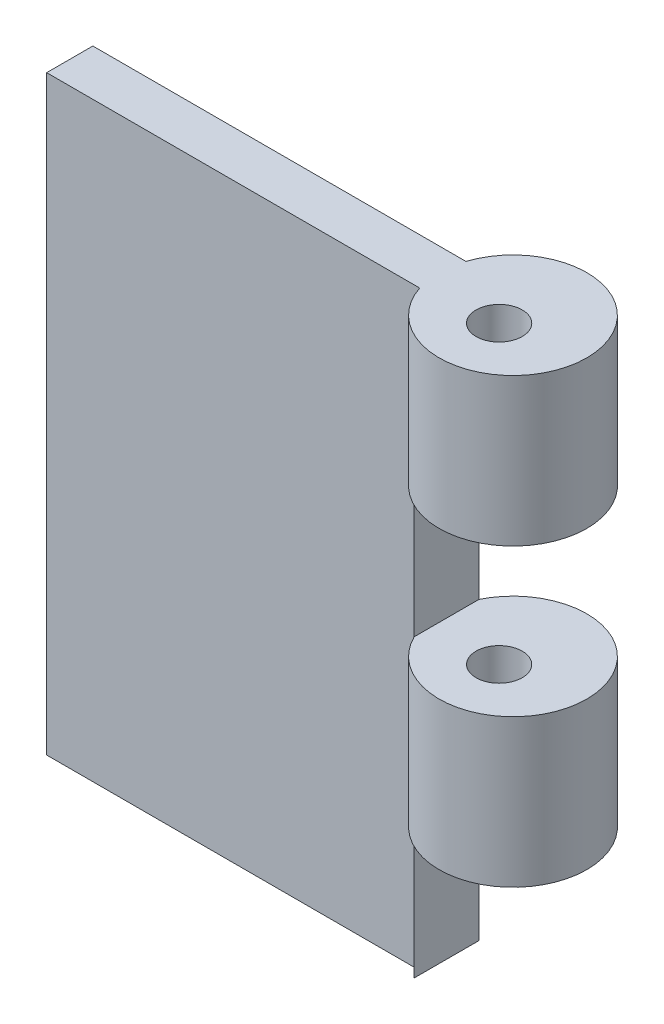
ISO-10303-21;
HEADER;
FILE_DESCRIPTION(('STEP AP214'),'2;1');
FILE_NAME('part.step','',(''),(''),'','','');
FILE_SCHEMA(('AUTOMOTIVE_DESIGN { 1 0 10303 214 1 1 1 1 }'));
ENDSEC;
DATA;
#1=APPLICATION_CONTEXT('core data for automotive mechanical design processes');
#2=APPLICATION_PROTOCOL_DEFINITION('international standard','automotive_design',2000,#1);
#3=PRODUCT_CONTEXT('',#1,'mechanical');
#4=PRODUCT('Part','Part','',(#3));
#5=PRODUCT_RELATED_PRODUCT_CATEGORY('part','',(#4));
#6=PRODUCT_DEFINITION_FORMATION('','',#4);
#7=PRODUCT_DEFINITION_CONTEXT('part definition',#1,'design');
#8=PRODUCT_DEFINITION('design','',#6,#7);
#9=PRODUCT_DEFINITION_SHAPE('','',#8);
#10=(LENGTH_UNIT() NAMED_UNIT(*) SI_UNIT(.MILLI.,.METRE.));
#11=(NAMED_UNIT(*) PLANE_ANGLE_UNIT() SI_UNIT($,.RADIAN.));
#12=(NAMED_UNIT(*) SI_UNIT($,.STERADIAN.) SOLID_ANGLE_UNIT());
#13=UNCERTAINTY_MEASURE_WITH_UNIT(LENGTH_MEASURE(1.E-05),#10,'distance_accuracy_value','');
#14=(GEOMETRIC_REPRESENTATION_CONTEXT(3) GLOBAL_UNCERTAINTY_ASSIGNED_CONTEXT((#13)) GLOBAL_UNIT_ASSIGNED_CONTEXT((#10,
#11,#12)) REPRESENTATION_CONTEXT('',''));
#15=CARTESIAN_POINT('',(0.,0.,0.));
#16=DIRECTION('',(0.,0.,1.));
#17=DIRECTION('',(1.,0.,0.));
#18=AXIS2_PLACEMENT_3D('',#15,#16,#17);
#19=CARTESIAN_POINT('',(7.61999999999999,10.16,1.27));
#20=DIRECTION('',(0.,1.,0.));
#21=DIRECTION('',(0.,0.,1.));
#22=AXIS2_PLACEMENT_3D('',#19,#20,#21);
#23=CYLINDRICAL_SURFACE('',#22,0.793749999999992);
#24=CARTESIAN_POINT('',(7.61999999999999,5.08,1.27));
#25=DIRECTION('',(0.,1.,0.));
#26=DIRECTION('',(-1.,0.,0.));
#27=AXIS2_PLACEMENT_3D('',#24,#25,#26);
#28=CIRCLE('',#27,0.793749999999992);
#29=CARTESIAN_POINT('',(6.82625,5.08,1.27));
#30=VERTEX_POINT('',#29);
#31=EDGE_CURVE('E153',#30,#30,#28,.F.);
#32=ORIENTED_EDGE('',*,*,#31,.T.);
#33=EDGE_LOOP('',(#32));
#34=FACE_BOUND('',#33,.T.);
#35=CARTESIAN_POINT('',(7.61999999999999,10.16,1.27));
#36=DIRECTION('',(0.,1.,0.));
#37=DIRECTION('',(0.,0.,1.));
#38=AXIS2_PLACEMENT_3D('',#35,#36,#37);
#39=CIRCLE('',#38,0.793749999999987);
#40=CARTESIAN_POINT('',(7.61999999999999,10.16,2.06374999999999));
#41=VERTEX_POINT('',#40);
#42=EDGE_CURVE('E171',#41,#41,#39,.T.);
#43=ORIENTED_EDGE('',*,*,#42,.T.);
#44=EDGE_LOOP('',(#43));
#45=FACE_BOUND('',#44,.T.);
#46=ADVANCED_FACE('F35',(#34,#45),#23,.F.);
#47=CARTESIAN_POINT('',(-7.62000000000001,10.16,1.5875));
#48=DIRECTION('',(0.,-1.,0.));
#49=DIRECTION('',(0.,0.,-1.));
#50=AXIS2_PLACEMENT_3D('',#47,#48,#49);
#51=PLANE('',#50);
#52=ORIENTED_EDGE('',*,*,#42,.F.);
#53=EDGE_LOOP('',(#52));
#54=FACE_BOUND('',#53,.T.);
#55=DIRECTION('',(-1.,0.,0.));
#56=VECTOR('',#55,1.);
#57=CARTESIAN_POINT('',(-7.62000000000001,10.16,1.5875));
#58=LINE('',#57,#56);
#59=CARTESIAN_POINT('',(5.20720889062065,10.16,1.5875));
#60=VERTEX_POINT('',#59);
#61=CARTESIAN_POINT('',(-7.62000000000001,10.16,1.5875));
#62=VERTEX_POINT('',#61);
#63=EDGE_CURVE('E129',#60,#62,#58,.T.);
#64=ORIENTED_EDGE('',*,*,#63,.F.);
#65=CARTESIAN_POINT('',(7.61999999999999,10.16,0.79375));
#66=DIRECTION('',(0.,-1.,0.));
#67=DIRECTION('',(0.,0.,-1.));
#68=AXIS2_PLACEMENT_3D('',#65,#66,#67);
#69=CIRCLE('',#68,2.54);
#70=CARTESIAN_POINT('',(5.20720889062065,10.16,0.));
#71=VERTEX_POINT('',#70);
#72=EDGE_CURVE('E125',#71,#60,#69,.T.);
#73=ORIENTED_EDGE('',*,*,#72,.F.);
#74=DIRECTION('',(-1.,0.,0.));
#75=VECTOR('',#74,1.);
#76=CARTESIAN_POINT('',(-7.62000000000001,10.16,0.));
#77=LINE('',#76,#75);
#78=CARTESIAN_POINT('',(-7.62000000000001,10.16,0.));
#79=VERTEX_POINT('',#78);
#80=EDGE_CURVE('E123',#71,#79,#77,.T.);
#81=ORIENTED_EDGE('',*,*,#80,.T.);
#82=DIRECTION('',(0.,0.,-1.));
#83=VECTOR('',#82,1.);
#84=CARTESIAN_POINT('',(-7.62000000000001,10.16,1.5875));
#85=LINE('',#84,#83);
#86=EDGE_CURVE('E142',#62,#79,#85,.T.);
#87=ORIENTED_EDGE('',*,*,#86,.F.);
#88=EDGE_LOOP('',(#64,#73,#81,#87));
#89=FACE_BOUND('',#88,.T.);
#90=ADVANCED_FACE('F37',(#54,#89),#51,.F.);
#91=CARTESIAN_POINT('',(-7.62000000000001,-10.16,1.5875));
#92=DIRECTION('',(1.,0.,0.));
#93=DIRECTION('',(0.,0.,-1.));
#94=AXIS2_PLACEMENT_3D('',#91,#92,#93);
#95=PLANE('',#94);
#96=DIRECTION('',(0.,-1.,0.));
#97=VECTOR('',#96,1.);
#98=CARTESIAN_POINT('',(-7.62000000000001,-10.16,0.));
#99=LINE('',#98,#97);
#100=CARTESIAN_POINT('',(-7.62000000000001,-10.16,0.));
#101=VERTEX_POINT('',#100);
#102=EDGE_CURVE('E138',#79,#101,#99,.T.);
#103=ORIENTED_EDGE('',*,*,#102,.T.);
#104=DIRECTION('',(0.,0.,-1.));
#105=VECTOR('',#104,1.);
#106=CARTESIAN_POINT('',(-7.62000000000001,-10.16,1.5875));
#107=LINE('',#106,#105);
#108=CARTESIAN_POINT('',(-7.62000000000001,-10.16,1.5875));
#109=VERTEX_POINT('',#108);
#110=EDGE_CURVE('E136',#109,#101,#107,.T.);
#111=ORIENTED_EDGE('',*,*,#110,.F.);
#112=DIRECTION('',(0.,-1.,0.));
#113=VECTOR('',#112,1.);
#114=CARTESIAN_POINT('',(-7.62000000000001,-10.16,1.5875));
#115=LINE('',#114,#113);
#116=EDGE_CURVE('E131',#62,#109,#115,.T.);
#117=ORIENTED_EDGE('',*,*,#116,.F.);
#118=ORIENTED_EDGE('',*,*,#86,.T.);
#119=EDGE_LOOP('',(#103,#111,#117,#118));
#120=FACE_BOUND('',#119,.T.);
#121=ADVANCED_FACE('F187',(#120),#95,.F.);
#122=CARTESIAN_POINT('',(-7.62000000000001,-10.16,1.5875));
#123=DIRECTION('',(0.,1.,0.));
#124=DIRECTION('',(0.,0.,1.));
#125=AXIS2_PLACEMENT_3D('',#122,#123,#124);
#126=PLANE('',#125);
#127=CARTESIAN_POINT('',(7.61999999999999,-10.16,0.79375));
#128=DIRECTION('',(0.,-1.,0.));
#129=DIRECTION('',(0.,0.,-1.));
#130=AXIS2_PLACEMENT_3D('',#127,#128,#129);
#131=CIRCLE('',#130,2.54);
#132=CARTESIAN_POINT('',(5.20720889062065,-10.16,0.));
#133=VERTEX_POINT('',#132);
#134=CARTESIAN_POINT('',(5.33735489851311,-10.16,-0.320310743702045));
#135=VERTEX_POINT('',#134);
#136=EDGE_CURVE('E111',#133,#135,#131,.T.);
#137=ORIENTED_EDGE('',*,*,#136,.T.);
#138=DIRECTION('',(0.,0.,1.));
#139=VECTOR('',#138,1.);
#140=CARTESIAN_POINT('',(5.33735489851311,-10.16,-4.7625));
#141=LINE('',#140,#139);
#142=CARTESIAN_POINT('',(5.33735489851311,-10.16,1.90781074370205));
#143=VERTEX_POINT('',#142);
#144=EDGE_CURVE('E98',#135,#143,#141,.T.);
#145=ORIENTED_EDGE('',*,*,#144,.T.);
#146=CARTESIAN_POINT('',(5.20720889062065,-10.16,1.5875));
#147=VERTEX_POINT('',#146);
#148=EDGE_CURVE('E120',#143,#147,#131,.T.);
#149=ORIENTED_EDGE('',*,*,#148,.T.);
#150=DIRECTION('',(1.,0.,0.));
#151=VECTOR('',#150,1.);
#152=CARTESIAN_POINT('',(-7.62000000000001,-10.16,1.5875));
#153=LINE('',#152,#151);
#154=EDGE_CURVE('E133',#109,#147,#153,.T.);
#155=ORIENTED_EDGE('',*,*,#154,.F.);
#156=ORIENTED_EDGE('',*,*,#110,.T.);
#157=DIRECTION('',(1.,0.,0.));
#158=VECTOR('',#157,1.);
#159=CARTESIAN_POINT('',(-7.62000000000001,-10.16,0.));
#160=LINE('',#159,#158);
#161=EDGE_CURVE('E118',#101,#133,#160,.T.);
#162=ORIENTED_EDGE('',*,*,#161,.T.);
#163=EDGE_LOOP('',(#137,#145,#149,#155,#156,#162));
#164=FACE_BOUND('',#163,.T.);
#165=ADVANCED_FACE('F115',(#164),#126,.F.);
#166=CARTESIAN_POINT('',(0.,0.,1.5875));
#167=DIRECTION('',(0.,0.,-1.));
#168=DIRECTION('',(-1.,0.,0.));
#169=AXIS2_PLACEMENT_3D('',#166,#167,#168);
#170=PLANE('',#169);
#171=ORIENTED_EDGE('',*,*,#154,.T.);
#172=DIRECTION('',(0.,-1.,0.));
#173=VECTOR('',#172,1.);
#174=CARTESIAN_POINT('',(5.20720889062065,-10.16,1.5875));
#175=LINE('',#174,#173);
#176=EDGE_CURVE('E119',#147,#60,#175,.F.);
#177=ORIENTED_EDGE('',*,*,#176,.T.);
#178=ORIENTED_EDGE('',*,*,#63,.T.);
#179=ORIENTED_EDGE('',*,*,#116,.T.);
#180=EDGE_LOOP('',(#171,#177,#178,#179));
#181=FACE_BOUND('',#180,.T.);
#182=ADVANCED_FACE('F180',(#181),#170,.F.);
#183=CARTESIAN_POINT('',(0.,0.,0.));
#184=DIRECTION('',(0.,0.,-1.));
#185=DIRECTION('',(-1.,0.,0.));
#186=AXIS2_PLACEMENT_3D('',#183,#184,#185);
#187=PLANE('',#186);
#188=DIRECTION('',(0.,-1.,0.));
#189=VECTOR('',#188,1.);
#190=CARTESIAN_POINT('',(5.20720889062065,-10.16,0.));
#191=LINE('',#190,#189);
#192=EDGE_CURVE('E145',#133,#71,#191,.F.);
#193=ORIENTED_EDGE('',*,*,#192,.F.);
#194=ORIENTED_EDGE('',*,*,#161,.F.);
#195=ORIENTED_EDGE('',*,*,#102,.F.);
#196=ORIENTED_EDGE('',*,*,#80,.F.);
#197=EDGE_LOOP('',(#193,#194,#195,#196));
#198=FACE_BOUND('',#197,.T.);
#199=ADVANCED_FACE('F189',(#198),#187,.T.);
#200=CARTESIAN_POINT('',(7.61999999999999,-10.16,0.79375));
#201=DIRECTION('',(0.,-1.,0.));
#202=DIRECTION('',(0.,0.,-1.));
#203=AXIS2_PLACEMENT_3D('',#200,#201,#202);
#204=CYLINDRICAL_SURFACE('',#203,2.54);
#205=DIRECTION('',(0.,-1.,0.));
#206=VECTOR('',#205,1.);
#207=CARTESIAN_POINT('',(5.33735489851311,-10.16,-0.320310743702045));
#208=LINE('',#207,#206);
#209=CARTESIAN_POINT('',(5.33735489851311,-5.08,-0.320310743702044));
#210=VERTEX_POINT('',#209);
#211=EDGE_CURVE('E11',#135,#210,#208,.F.);
#212=ORIENTED_EDGE('',*,*,#211,.F.);
#213=ORIENTED_EDGE('',*,*,#136,.F.);
#214=ORIENTED_EDGE('',*,*,#192,.T.);
#215=ORIENTED_EDGE('',*,*,#72,.T.);
#216=ORIENTED_EDGE('',*,*,#176,.F.);
#217=ORIENTED_EDGE('',*,*,#148,.F.);
#218=DIRECTION('',(0.,-1.,0.));
#219=VECTOR('',#218,1.);
#220=CARTESIAN_POINT('',(5.33735489851311,-10.16,1.90781074370205));
#221=LINE('',#220,#219);
#222=CARTESIAN_POINT('',(5.33735489851311,-5.08,1.90781074370204));
#223=VERTEX_POINT('',#222);
#224=EDGE_CURVE('E43',#223,#143,#221,.T.);
#225=ORIENTED_EDGE('',*,*,#224,.F.);
#226=CARTESIAN_POINT('',(7.61999999999999,-5.08,0.79375));
#227=DIRECTION('',(0.,1.,0.));
#228=DIRECTION('',(-1.,0.,0.));
#229=AXIS2_PLACEMENT_3D('',#226,#227,#228);
#230=CIRCLE('',#229,2.54);
#231=EDGE_CURVE('E113',#210,#223,#230,.F.);
#232=ORIENTED_EDGE('',*,*,#231,.F.);
#233=EDGE_LOOP('',(#212,#213,#214,#215,#216,#217,#225,#232));
#234=FACE_BOUND('',#233,.T.);
#235=CARTESIAN_POINT('',(7.61999999999999,5.08,0.79375));
#236=DIRECTION('',(0.,1.,0.));
#237=DIRECTION('',(-1.,0.,0.));
#238=AXIS2_PLACEMENT_3D('',#235,#236,#237);
#239=CIRCLE('',#238,2.54);
#240=CARTESIAN_POINT('',(5.33735489851311,5.08,-0.320310743702044));
#241=VERTEX_POINT('',#240);
#242=CARTESIAN_POINT('',(5.33735489851311,5.08,1.90781074370204));
#243=VERTEX_POINT('',#242);
#244=EDGE_CURVE('E156',#241,#243,#239,.F.);
#245=ORIENTED_EDGE('',*,*,#244,.F.);
#246=DIRECTION('',(0.,-1.,0.));
#247=VECTOR('',#246,1.);
#248=CARTESIAN_POINT('',(5.33735489851311,-10.16,-0.320310743702049));
#249=LINE('',#248,#247);
#250=CARTESIAN_POINT('',(5.33735489851311,0.,-0.320310743702045));
#251=VERTEX_POINT('',#250);
#252=EDGE_CURVE('E158',#251,#241,#249,.F.);
#253=ORIENTED_EDGE('',*,*,#252,.F.);
#254=CARTESIAN_POINT('',(7.61999999999999,0.,0.79375));
#255=DIRECTION('',(0.,-1.,0.));
#256=DIRECTION('',(0.,0.,-1.));
#257=AXIS2_PLACEMENT_3D('',#254,#255,#256);
#258=CIRCLE('',#257,2.54);
#259=CARTESIAN_POINT('',(5.33735489851311,0.,1.90781074370205));
#260=VERTEX_POINT('',#259);
#261=EDGE_CURVE('E151',#260,#251,#258,.F.);
#262=ORIENTED_EDGE('',*,*,#261,.F.);
#263=DIRECTION('',(0.,-1.,0.));
#264=VECTOR('',#263,1.);
#265=CARTESIAN_POINT('',(5.33735489851311,-10.16,1.90781074370205));
#266=LINE('',#265,#264);
#267=EDGE_CURVE('E147',#243,#260,#266,.T.);
#268=ORIENTED_EDGE('',*,*,#267,.F.);
#269=EDGE_LOOP('',(#245,#253,#262,#268));
#270=FACE_BOUND('',#269,.T.);
#271=ADVANCED_FACE('F108',(#234,#270),#204,.T.);
#272=CARTESIAN_POINT('',(7.61999999999999,-5.08,1.27));
#273=DIRECTION('',(0.,1.,0.));
#274=DIRECTION('',(-1.,0.,0.));
#275=AXIS2_PLACEMENT_3D('',#272,#273,#274);
#276=CIRCLE('',#275,0.793749999999992);
#277=CARTESIAN_POINT('',(6.82625,-5.08,1.27));
#278=VERTEX_POINT('',#277);
#279=EDGE_CURVE('E160',#278,#278,#276,.F.);
#280=ORIENTED_EDGE('',*,*,#279,.T.);
#281=EDGE_LOOP('',(#280));
#282=FACE_BOUND('',#281,.T.);
#283=CARTESIAN_POINT('',(7.61999999999999,0.,1.27));
#284=DIRECTION('',(0.,-1.,0.));
#285=DIRECTION('',(0.,0.,-1.));
#286=AXIS2_PLACEMENT_3D('',#283,#284,#285);
#287=CIRCLE('',#286,0.793749999999992);
#288=CARTESIAN_POINT('',(7.61999999999999,0.,0.476250000000008));
#289=VERTEX_POINT('',#288);
#290=EDGE_CURVE('E148',#289,#289,#287,.F.);
#291=ORIENTED_EDGE('',*,*,#290,.T.);
#292=EDGE_LOOP('',(#291));
#293=FACE_BOUND('',#292,.T.);
#294=ADVANCED_FACE('F196',(#282,#293),#23,.F.);
#295=CARTESIAN_POINT('',(5.33735489851311,5.08,-4.7625));
#296=DIRECTION('',(0.,1.,0.));
#297=DIRECTION('',(-1.,0.,0.));
#298=AXIS2_PLACEMENT_3D('',#295,#296,#297);
#299=PLANE('',#298);
#300=ORIENTED_EDGE('',*,*,#244,.T.);
#301=DIRECTION('',(0.,0.,1.));
#302=VECTOR('',#301,1.);
#303=CARTESIAN_POINT('',(5.33735489851311,5.08,-4.7625));
#304=LINE('',#303,#302);
#305=EDGE_CURVE('E152',#241,#243,#304,.T.);
#306=ORIENTED_EDGE('',*,*,#305,.F.);
#307=EDGE_LOOP('',(#300,#306));
#308=FACE_BOUND('',#307,.T.);
#309=ORIENTED_EDGE('',*,*,#31,.F.);
#310=EDGE_LOOP('',(#309));
#311=FACE_BOUND('',#310,.T.);
#312=ADVANCED_FACE('F209',(#308,#311),#299,.F.);
#313=CARTESIAN_POINT('',(5.33735489851311,0.,-4.7625));
#314=DIRECTION('',(0.,-1.,0.));
#315=DIRECTION('',(0.,0.,-1.));
#316=AXIS2_PLACEMENT_3D('',#313,#314,#315);
#317=PLANE('',#316);
#318=ORIENTED_EDGE('',*,*,#261,.T.);
#319=DIRECTION('',(0.,0.,1.));
#320=VECTOR('',#319,1.);
#321=CARTESIAN_POINT('',(5.33735489851311,0.,-4.7625));
#322=LINE('',#321,#320);
#323=EDGE_CURVE('E55',#251,#260,#322,.T.);
#324=ORIENTED_EDGE('',*,*,#323,.T.);
#325=EDGE_LOOP('',(#318,#324));
#326=FACE_BOUND('',#325,.T.);
#327=ORIENTED_EDGE('',*,*,#290,.F.);
#328=EDGE_LOOP('',(#327));
#329=FACE_BOUND('',#328,.T.);
#330=ADVANCED_FACE('F213',(#326,#329),#317,.F.);
#331=CARTESIAN_POINT('',(5.33735489851311,5.08,-4.7625));
#332=DIRECTION('',(-1.,0.,0.));
#333=DIRECTION('',(0.,-1.,0.));
#334=AXIS2_PLACEMENT_3D('',#331,#332,#333);
#335=PLANE('',#334);
#336=ORIENTED_EDGE('',*,*,#252,.T.);
#337=ORIENTED_EDGE('',*,*,#305,.T.);
#338=ORIENTED_EDGE('',*,*,#267,.T.);
#339=ORIENTED_EDGE('',*,*,#323,.F.);
#340=EDGE_LOOP('',(#336,#337,#338,#339));
#341=FACE_BOUND('',#340,.T.);
#342=ADVANCED_FACE('F220',(#341),#335,.F.);
#343=CARTESIAN_POINT('',(5.33735489851311,-5.08,-4.7625));
#344=DIRECTION('',(0.,1.,0.));
#345=DIRECTION('',(-1.,0.,0.));
#346=AXIS2_PLACEMENT_3D('',#343,#344,#345);
#347=PLANE('',#346);
#348=ORIENTED_EDGE('',*,*,#231,.T.);
#349=DIRECTION('',(0.,0.,1.));
#350=VECTOR('',#349,1.);
#351=CARTESIAN_POINT('',(5.33735489851311,-5.08,-4.7625));
#352=LINE('',#351,#350);
#353=EDGE_CURVE('E49',#210,#223,#352,.T.);
#354=ORIENTED_EDGE('',*,*,#353,.F.);
#355=EDGE_LOOP('',(#348,#354));
#356=FACE_BOUND('',#355,.T.);
#357=ORIENTED_EDGE('',*,*,#279,.F.);
#358=EDGE_LOOP('',(#357));
#359=FACE_BOUND('',#358,.T.);
#360=ADVANCED_FACE('F225',(#356,#359),#347,.F.);
#361=CARTESIAN_POINT('',(5.33735489851311,-5.08,-4.7625));
#362=DIRECTION('',(-1.,0.,0.));
#363=DIRECTION('',(0.,-1.,0.));
#364=AXIS2_PLACEMENT_3D('',#361,#362,#363);
#365=PLANE('',#364);
#366=ORIENTED_EDGE('',*,*,#211,.T.);
#367=ORIENTED_EDGE('',*,*,#353,.T.);
#368=ORIENTED_EDGE('',*,*,#224,.T.);
#369=ORIENTED_EDGE('',*,*,#144,.F.);
#370=EDGE_LOOP('',(#366,#367,#368,#369));
#371=FACE_BOUND('',#370,.T.);
#372=ADVANCED_FACE('F100',(#371),#365,.F.);
#373=CLOSED_SHELL('',(#46,#90,#121,#165,#182,#199,#271,#294,#312,#330,#342,#360,#372));
#374=MANIFOLD_SOLID_BREP('B2',#373);
#375=ADVANCED_BREP_SHAPE_REPRESENTATION('',(#18,#374),#14);
#376=SHAPE_DEFINITION_REPRESENTATION(#9,#375);
ENDSEC;
END-ISO-10303-21;
